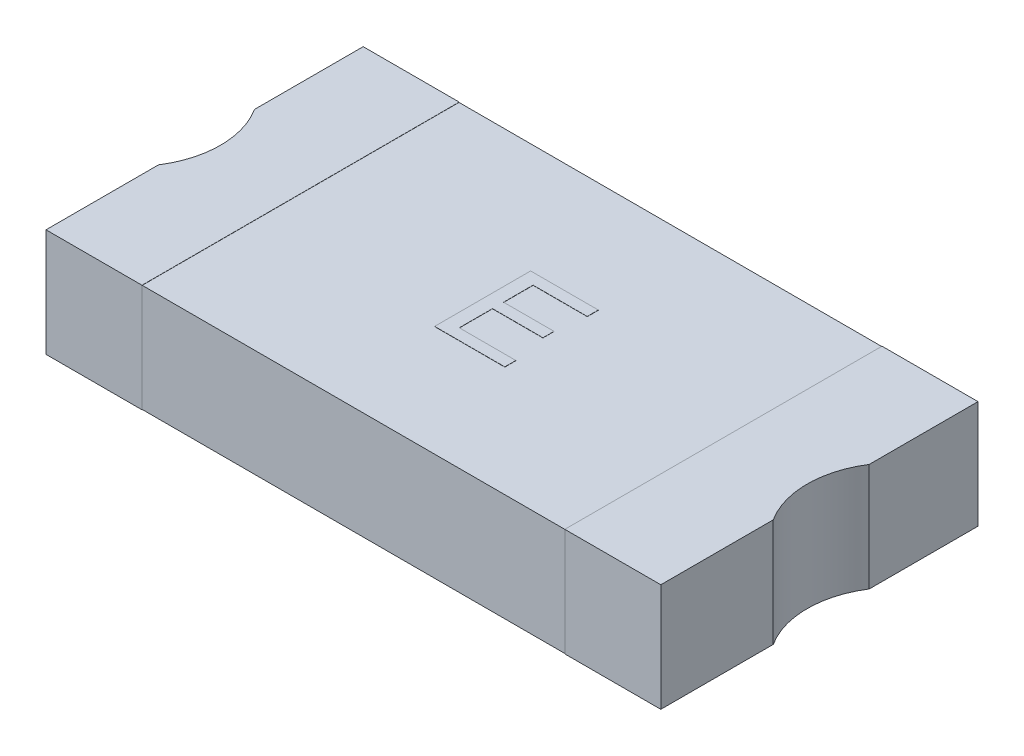
ISO-10303-21;
HEADER;
FILE_DESCRIPTION(('STEP AP214'),'2;1');
FILE_NAME('part.step','',(''),(''),'','','');
FILE_SCHEMA(('AUTOMOTIVE_DESIGN { 1 0 10303 214 1 1 1 1 }'));
ENDSEC;
DATA;
#1=APPLICATION_CONTEXT('core data for automotive mechanical design processes');
#2=APPLICATION_PROTOCOL_DEFINITION('international standard','automotive_design',2000,#1);
#3=PRODUCT_CONTEXT('',#1,'mechanical');
#4=PRODUCT('Part','Part','',(#3));
#5=PRODUCT_RELATED_PRODUCT_CATEGORY('part','',(#4));
#6=PRODUCT_DEFINITION_FORMATION('','',#4);
#7=PRODUCT_DEFINITION_CONTEXT('part definition',#1,'design');
#8=PRODUCT_DEFINITION('design','',#6,#7);
#9=PRODUCT_DEFINITION_SHAPE('','',#8);
#10=(LENGTH_UNIT() NAMED_UNIT(*) SI_UNIT(.MILLI.,.METRE.));
#11=(NAMED_UNIT(*) PLANE_ANGLE_UNIT() SI_UNIT($,.RADIAN.));
#12=(NAMED_UNIT(*) SI_UNIT($,.STERADIAN.) SOLID_ANGLE_UNIT());
#13=UNCERTAINTY_MEASURE_WITH_UNIT(LENGTH_MEASURE(1.E-05),#10,'distance_accuracy_value','');
#14=(GEOMETRIC_REPRESENTATION_CONTEXT(3) GLOBAL_UNCERTAINTY_ASSIGNED_CONTEXT((#13)) GLOBAL_UNIT_ASSIGNED_CONTEXT((#10,
#11,#12)) REPRESENTATION_CONTEXT('',''));
#15=CARTESIAN_POINT('',(0.,0.,0.));
#16=DIRECTION('',(0.,0.,1.));
#17=DIRECTION('',(1.,0.,0.));
#18=AXIS2_PLACEMENT_3D('',#15,#16,#17);
#19=CARTESIAN_POINT('',(-0.153338424141,0.561,0.249571173603));
#20=DIRECTION('',(0.,-1.,0.));
#21=DIRECTION('',(0.,0.,-1.));
#22=AXIS2_PLACEMENT_3D('',#19,#20,#21);
#23=PLANE('',#22);
#24=DIRECTION('',(0.,0.,-1.));
#25=VECTOR('',#24,1.);
#26=CARTESIAN_POINT('',(0.212046191244,0.561,0.19187886591));
#27=LINE('',#26,#25);
#28=CARTESIAN_POINT('',(0.212046191244,0.561,0.19187886591));
#29=VERTEX_POINT('',#28);
#30=CARTESIAN_POINT('',(0.212046191244,0.561,0.249571173603));
#31=VERTEX_POINT('',#30);
#32=EDGE_CURVE('E299',#29,#31,#27,.F.);
#33=ORIENTED_EDGE('',*,*,#32,.F.);
#34=DIRECTION('',(-1.,0.,0.));
#35=VECTOR('',#34,1.);
#36=CARTESIAN_POINT('',(-0.08282560362813,0.561,0.19187886591));
#37=LINE('',#36,#35);
#38=CARTESIAN_POINT('',(-0.08282560362813,0.561,0.19187886591));
#39=VERTEX_POINT('',#38);
#40=EDGE_CURVE('E303',#39,#29,#37,.F.);
#41=ORIENTED_EDGE('',*,*,#40,.F.);
#42=DIRECTION('',(0.,0.,-1.));
#43=VECTOR('',#42,1.);
#44=CARTESIAN_POINT('',(-0.08282560362813,0.561,0.01880194283357));
#45=LINE('',#44,#43);
#46=CARTESIAN_POINT('',(-0.08282560362813,0.561,0.01880194283357));
#47=VERTEX_POINT('',#46);
#48=EDGE_CURVE('E307',#47,#39,#45,.F.);
#49=ORIENTED_EDGE('',*,*,#48,.F.);
#50=DIRECTION('',(1.,0.,0.));
#51=VECTOR('',#50,1.);
#52=CARTESIAN_POINT('',(0.179994909192,0.561,0.01880194283357));
#53=LINE('',#52,#51);
#54=CARTESIAN_POINT('',(0.179994909192,0.561,0.01880194283357));
#55=VERTEX_POINT('',#54);
#56=EDGE_CURVE('E311',#55,#47,#53,.F.);
#57=ORIENTED_EDGE('',*,*,#56,.F.);
#58=DIRECTION('',(0.,0.,-1.));
#59=VECTOR('',#58,1.);
#60=CARTESIAN_POINT('',(0.179994909192,0.561,-0.03889036485874));
#61=LINE('',#60,#59);
#62=CARTESIAN_POINT('',(0.179994909192,0.561,-0.03889036485874));
#63=VERTEX_POINT('',#62);
#64=EDGE_CURVE('E315',#63,#55,#61,.F.);
#65=ORIENTED_EDGE('',*,*,#64,.F.);
#66=DIRECTION('',(-1.,0.,0.));
#67=VECTOR('',#66,1.);
#68=CARTESIAN_POINT('',(-0.08282560362813,0.561,-0.03889036485874));
#69=LINE('',#68,#67);
#70=CARTESIAN_POINT('',(-0.08282560362813,0.561,-0.03889036485874));
#71=VERTEX_POINT('',#70);
#72=EDGE_CURVE('E319',#71,#63,#69,.F.);
#73=ORIENTED_EDGE('',*,*,#72,.F.);
#74=DIRECTION('',(0.,0.,-1.));
#75=VECTOR('',#74,1.);
#76=CARTESIAN_POINT('',(-0.08282560362813,0.561,-0.192736518705));
#77=LINE('',#76,#75);
#78=CARTESIAN_POINT('',(-0.08282560362813,0.561,-0.192736518705));
#79=VERTEX_POINT('',#78);
#80=EDGE_CURVE('E323',#79,#71,#77,.F.);
#81=ORIENTED_EDGE('',*,*,#80,.F.);
#82=DIRECTION('',(1.,0.,0.));
#83=VECTOR('',#82,1.);
#84=CARTESIAN_POINT('',(0.199225678423,0.561,-0.192736518705));
#85=LINE('',#84,#83);
#86=CARTESIAN_POINT('',(0.199225678423,0.561,-0.192736518705));
#87=VERTEX_POINT('',#86);
#88=EDGE_CURVE('E327',#87,#79,#85,.F.);
#89=ORIENTED_EDGE('',*,*,#88,.F.);
#90=DIRECTION('',(0.,0.,-1.));
#91=VECTOR('',#90,1.);
#92=CARTESIAN_POINT('',(0.199225678423,0.561,-0.250428826397));
#93=LINE('',#92,#91);
#94=CARTESIAN_POINT('',(0.199225678423,0.561,-0.250428826397));
#95=VERTEX_POINT('',#94);
#96=EDGE_CURVE('E331',#95,#87,#93,.F.);
#97=ORIENTED_EDGE('',*,*,#96,.F.);
#98=DIRECTION('',(-1.,0.,0.));
#99=VECTOR('',#98,1.);
#100=CARTESIAN_POINT('',(-0.153338424141,0.561,-0.250428826397));
#101=LINE('',#100,#99);
#102=CARTESIAN_POINT('',(-0.153338424141,0.561,-0.250428826397));
#103=VERTEX_POINT('',#102);
#104=EDGE_CURVE('E228',#103,#95,#101,.F.);
#105=ORIENTED_EDGE('',*,*,#104,.F.);
#106=DIRECTION('',(0.,0.,1.));
#107=VECTOR('',#106,1.);
#108=CARTESIAN_POINT('',(-0.153338424141,0.561,0.249571173603));
#109=LINE('',#108,#107);
#110=CARTESIAN_POINT('',(-0.153338424141,0.561,0.249571173603));
#111=VERTEX_POINT('',#110);
#112=EDGE_CURVE('E217',#111,#103,#109,.F.);
#113=ORIENTED_EDGE('',*,*,#112,.F.);
#114=DIRECTION('',(1.,0.,0.));
#115=VECTOR('',#114,1.);
#116=CARTESIAN_POINT('',(0.212046191244,0.561,0.249571173603));
#117=LINE('',#116,#115);
#118=EDGE_CURVE('E214',#31,#111,#117,.F.);
#119=ORIENTED_EDGE('',*,*,#118,.F.);
#120=EDGE_LOOP('',(#33,#41,#49,#57,#65,#73,#81,#89,#97,#105,#113,#119));
#121=FACE_BOUND('',#120,.T.);
#122=ADVANCED_FACE('F17',(#121),#23,.F.);
#123=CARTESIAN_POINT('',(-1.601,0.561,-0.25961123323));
#124=DIRECTION('',(1.,0.,0.));
#125=DIRECTION('',(0.,0.,-1.));
#126=AXIS2_PLACEMENT_3D('',#123,#124,#125);
#127=PLANE('',#126);
#128=DIRECTION('',(0.,0.,1.));
#129=VECTOR('',#128,1.);
#130=CARTESIAN_POINT('',(-1.601,-0.001,-0.009604738494877));
#131=LINE('',#130,#129);
#132=CARTESIAN_POINT('',(-1.601,-0.00100000000000001,-0.826));
#133=VERTEX_POINT('',#132);
#134=CARTESIAN_POINT('',(-1.60099999999998,-0.00100000000000002,-0.259611233230056));
#135=VERTEX_POINT('',#134);
#136=EDGE_CURVE('E250',#133,#135,#131,.T.);
#137=ORIENTED_EDGE('',*,*,#136,.T.);
#138=DIRECTION('',(0.,-1.,0.));
#139=VECTOR('',#138,1.);
#140=CARTESIAN_POINT('',(-1.60099999999996,0.561,-0.259611233230025));
#141=LINE('',#140,#139);
#142=CARTESIAN_POINT('',(-1.60099999999998,0.561,-0.259611233230056));
#143=VERTEX_POINT('',#142);
#144=EDGE_CURVE('E234',#135,#143,#141,.F.);
#145=ORIENTED_EDGE('',*,*,#144,.T.);
#146=DIRECTION('',(0.,0.,1.));
#147=VECTOR('',#146,1.);
#148=CARTESIAN_POINT('',(-1.601,0.561,-0.009604738494877));
#149=LINE('',#148,#147);
#150=CARTESIAN_POINT('',(-1.601,0.561,-0.826));
#151=VERTEX_POINT('',#150);
#152=EDGE_CURVE('E295',#151,#143,#149,.T.);
#153=ORIENTED_EDGE('',*,*,#152,.F.);
#154=DIRECTION('',(0.,1.,0.));
#155=VECTOR('',#154,1.);
#156=CARTESIAN_POINT('',(-1.601,0.561,-0.826));
#157=LINE('',#156,#155);
#158=EDGE_CURVE('E247',#151,#133,#157,.F.);
#159=ORIENTED_EDGE('',*,*,#158,.T.);
#160=EDGE_LOOP('',(#137,#145,#153,#159));
#161=FACE_BOUND('',#160,.T.);
#162=ADVANCED_FACE('F604',(#161),#127,.F.);
#163=CARTESIAN_POINT('',(-1.991021354204,0.561,-0.009604738494877));
#164=DIRECTION('',(0.,-1.,0.));
#165=DIRECTION('',(0.,0.,-1.));
#166=AXIS2_PLACEMENT_3D('',#163,#164,#165);
#167=CYLINDRICAL_SURFACE('',#166,0.463270875563);
#168=DIRECTION('',(0.,1.,0.));
#169=VECTOR('',#168,1.);
#170=CARTESIAN_POINT('',(-1.601,0.561,0.24040175624));
#171=LINE('',#170,#169);
#172=CARTESIAN_POINT('',(-1.601,-0.00100000000000002,0.240401756240166));
#173=VERTEX_POINT('',#172);
#174=CARTESIAN_POINT('',(-1.601,0.561,0.240401756240166));
#175=VERTEX_POINT('',#174);
#176=EDGE_CURVE('E231',#173,#175,#171,.T.);
#177=ORIENTED_EDGE('',*,*,#176,.T.);
#178=CARTESIAN_POINT('',(-1.991021354204,0.561,-0.009604738494877));
#179=DIRECTION('',(0.,-1.,0.));
#180=DIRECTION('',(0.,0.,-1.));
#181=AXIS2_PLACEMENT_3D('',#178,#179,#180);
#182=CIRCLE('',#181,0.463270875563);
#183=EDGE_CURVE('E293',#143,#175,#182,.T.);
#184=ORIENTED_EDGE('',*,*,#183,.F.);
#185=ORIENTED_EDGE('',*,*,#144,.F.);
#186=CARTESIAN_POINT('',(-1.991021354204,-0.00100000000000002,-0.009604738494877));
#187=DIRECTION('',(0.,-1.,0.));
#188=DIRECTION('',(0.,0.,-1.));
#189=AXIS2_PLACEMENT_3D('',#186,#187,#188);
#190=CIRCLE('',#189,0.463270875563);
#191=EDGE_CURVE('E290',#135,#173,#190,.T.);
#192=ORIENTED_EDGE('',*,*,#191,.T.);
#193=EDGE_LOOP('',(#177,#184,#185,#192));
#194=FACE_BOUND('',#193,.T.);
#195=ADVANCED_FACE('F601',(#194),#167,.F.);
#196=CARTESIAN_POINT('',(-1.601,0.561,0.826));
#197=DIRECTION('',(1.,0.,0.));
#198=DIRECTION('',(0.,0.,-1.));
#199=AXIS2_PLACEMENT_3D('',#196,#197,#198);
#200=PLANE('',#199);
#201=DIRECTION('',(0.,0.,1.));
#202=VECTOR('',#201,1.);
#203=CARTESIAN_POINT('',(-1.601,-0.001,-0.009604738494877));
#204=LINE('',#203,#202);
#205=CARTESIAN_POINT('',(-1.601,-0.001,0.826));
#206=VERTEX_POINT('',#205);
#207=EDGE_CURVE('E257',#173,#206,#204,.T.);
#208=ORIENTED_EDGE('',*,*,#207,.T.);
#209=DIRECTION('',(0.,1.,0.));
#210=VECTOR('',#209,1.);
#211=CARTESIAN_POINT('',(-1.601,0.561,0.826));
#212=LINE('',#211,#210);
#213=CARTESIAN_POINT('',(-1.601,0.561,0.826));
#214=VERTEX_POINT('',#213);
#215=EDGE_CURVE('E208',#206,#214,#212,.T.);
#216=ORIENTED_EDGE('',*,*,#215,.T.);
#217=DIRECTION('',(0.,0.,1.));
#218=VECTOR('',#217,1.);
#219=CARTESIAN_POINT('',(-1.601,0.561,-0.009604738494877));
#220=LINE('',#219,#218);
#221=EDGE_CURVE('E262',#175,#214,#220,.T.);
#222=ORIENTED_EDGE('',*,*,#221,.F.);
#223=ORIENTED_EDGE('',*,*,#176,.F.);
#224=EDGE_LOOP('',(#208,#216,#222,#223));
#225=FACE_BOUND('',#224,.T.);
#226=ADVANCED_FACE('F598',(#225),#200,.F.);
#227=CARTESIAN_POINT('',(0.212046191244,0.561,0.249571173603));
#228=DIRECTION('',(0.,0.,1.));
#229=DIRECTION('',(1.,0.,0.));
#230=AXIS2_PLACEMENT_3D('',#227,#228,#229);
#231=PLANE('',#230);
#232=ORIENTED_EDGE('',*,*,#118,.T.);
#233=DIRECTION('',(0.,1.,0.));
#234=VECTOR('',#233,1.);
#235=CARTESIAN_POINT('',(-0.153338424141,0.561,0.249571173603));
#236=LINE('',#235,#234);
#237=CARTESIAN_POINT('',(-0.153338424141,0.56,0.249571173603));
#238=VERTEX_POINT('',#237);
#239=EDGE_CURVE('E20',#238,#111,#236,.T.);
#240=ORIENTED_EDGE('',*,*,#239,.F.);
#241=DIRECTION('',(1.,0.,0.));
#242=VECTOR('',#241,1.);
#243=CARTESIAN_POINT('',(0.,0.56,0.249571173603));
#244=LINE('',#243,#242);
#245=CARTESIAN_POINT('',(0.212046191244,0.56,0.249571173603));
#246=VERTEX_POINT('',#245);
#247=EDGE_CURVE('E198',#246,#238,#244,.F.);
#248=ORIENTED_EDGE('',*,*,#247,.F.);
#249=DIRECTION('',(0.,1.,0.));
#250=VECTOR('',#249,1.);
#251=CARTESIAN_POINT('',(0.212046191244,0.561,0.249571173603));
#252=LINE('',#251,#250);
#253=EDGE_CURVE('E296',#31,#246,#252,.F.);
#254=ORIENTED_EDGE('',*,*,#253,.F.);
#255=EDGE_LOOP('',(#232,#240,#248,#254));
#256=FACE_BOUND('',#255,.T.);
#257=ADVANCED_FACE('F212',(#256),#231,.T.);
#258=CARTESIAN_POINT('',(-0.153338424141,0.561,0.249571173603));
#259=DIRECTION('',(-1.,0.,0.));
#260=DIRECTION('',(0.,0.,1.));
#261=AXIS2_PLACEMENT_3D('',#258,#259,#260);
#262=PLANE('',#261);
#263=ORIENTED_EDGE('',*,*,#112,.T.);
#264=DIRECTION('',(0.,1.,0.));
#265=VECTOR('',#264,1.);
#266=CARTESIAN_POINT('',(-0.153338424141,0.561,-0.250428826397));
#267=LINE('',#266,#265);
#268=CARTESIAN_POINT('',(-0.153338424141,0.56,-0.250428826397));
#269=VERTEX_POINT('',#268);
#270=EDGE_CURVE('E220',#269,#103,#267,.T.);
#271=ORIENTED_EDGE('',*,*,#270,.F.);
#272=DIRECTION('',(0.,0.,1.));
#273=VECTOR('',#272,1.);
#274=CARTESIAN_POINT('',(-0.153338424141,0.56,0.));
#275=LINE('',#274,#273);
#276=EDGE_CURVE('E202',#238,#269,#275,.F.);
#277=ORIENTED_EDGE('',*,*,#276,.F.);
#278=ORIENTED_EDGE('',*,*,#239,.T.);
#279=EDGE_LOOP('',(#263,#271,#277,#278));
#280=FACE_BOUND('',#279,.T.);
#281=ADVANCED_FACE('F218',(#280),#262,.T.);
#282=CARTESIAN_POINT('',(-0.153338424141,0.561,-0.250428826397));
#283=DIRECTION('',(0.,0.,-1.));
#284=DIRECTION('',(-1.,0.,0.));
#285=AXIS2_PLACEMENT_3D('',#282,#283,#284);
#286=PLANE('',#285);
#287=ORIENTED_EDGE('',*,*,#104,.T.);
#288=DIRECTION('',(0.,1.,0.));
#289=VECTOR('',#288,1.);
#290=CARTESIAN_POINT('',(0.199225678423,0.561,-0.250428826397));
#291=LINE('',#290,#289);
#292=CARTESIAN_POINT('',(0.199225678423,0.56,-0.250428826397));
#293=VERTEX_POINT('',#292);
#294=EDGE_CURVE('E332',#293,#95,#291,.T.);
#295=ORIENTED_EDGE('',*,*,#294,.F.);
#296=DIRECTION('',(1.,0.,0.));
#297=VECTOR('',#296,1.);
#298=CARTESIAN_POINT('',(0.,0.56,-0.250428826397));
#299=LINE('',#298,#297);
#300=EDGE_CURVE('E222',#269,#293,#299,.T.);
#301=ORIENTED_EDGE('',*,*,#300,.F.);
#302=ORIENTED_EDGE('',*,*,#270,.T.);
#303=EDGE_LOOP('',(#287,#295,#301,#302));
#304=FACE_BOUND('',#303,.T.);
#305=ADVANCED_FACE('F337',(#304),#286,.T.);
#306=CARTESIAN_POINT('',(0.199225678423,0.561,-0.250428826397));
#307=DIRECTION('',(1.,0.,0.));
#308=DIRECTION('',(0.,0.,-1.));
#309=AXIS2_PLACEMENT_3D('',#306,#307,#308);
#310=PLANE('',#309);
#311=ORIENTED_EDGE('',*,*,#96,.T.);
#312=DIRECTION('',(0.,1.,0.));
#313=VECTOR('',#312,1.);
#314=CARTESIAN_POINT('',(0.199225678423,0.561,-0.192736518705));
#315=LINE('',#314,#313);
#316=CARTESIAN_POINT('',(0.199225678423,0.56,-0.192736518705));
#317=VERTEX_POINT('',#316);
#318=EDGE_CURVE('E328',#317,#87,#315,.T.);
#319=ORIENTED_EDGE('',*,*,#318,.F.);
#320=DIRECTION('',(0.,0.,1.));
#321=VECTOR('',#320,1.);
#322=CARTESIAN_POINT('',(0.199225678423,0.56,0.));
#323=LINE('',#322,#321);
#324=EDGE_CURVE('E224',#293,#317,#323,.T.);
#325=ORIENTED_EDGE('',*,*,#324,.F.);
#326=ORIENTED_EDGE('',*,*,#294,.T.);
#327=EDGE_LOOP('',(#311,#319,#325,#326));
#328=FACE_BOUND('',#327,.T.);
#329=ADVANCED_FACE('F342',(#328),#310,.T.);
#330=CARTESIAN_POINT('',(0.199225678423,0.561,-0.192736518705));
#331=DIRECTION('',(0.,0.,1.));
#332=DIRECTION('',(1.,0.,0.));
#333=AXIS2_PLACEMENT_3D('',#330,#331,#332);
#334=PLANE('',#333);
#335=ORIENTED_EDGE('',*,*,#88,.T.);
#336=DIRECTION('',(0.,1.,0.));
#337=VECTOR('',#336,1.);
#338=CARTESIAN_POINT('',(-0.08282560362813,0.561,-0.192736518705));
#339=LINE('',#338,#337);
#340=CARTESIAN_POINT('',(-0.08282560362813,0.56,-0.192736518705));
#341=VERTEX_POINT('',#340);
#342=EDGE_CURVE('E324',#341,#79,#339,.T.);
#343=ORIENTED_EDGE('',*,*,#342,.F.);
#344=DIRECTION('',(1.,0.,0.));
#345=VECTOR('',#344,1.);
#346=CARTESIAN_POINT('',(0.,0.56,-0.192736518705));
#347=LINE('',#346,#345);
#348=EDGE_CURVE('E350',#317,#341,#347,.F.);
#349=ORIENTED_EDGE('',*,*,#348,.F.);
#350=ORIENTED_EDGE('',*,*,#318,.T.);
#351=EDGE_LOOP('',(#335,#343,#349,#350));
#352=FACE_BOUND('',#351,.T.);
#353=ADVANCED_FACE('F585',(#352),#334,.T.);
#354=CARTESIAN_POINT('',(-0.08282560362813,0.561,-0.192736518705));
#355=DIRECTION('',(1.,0.,0.));
#356=DIRECTION('',(0.,0.,-1.));
#357=AXIS2_PLACEMENT_3D('',#354,#355,#356);
#358=PLANE('',#357);
#359=ORIENTED_EDGE('',*,*,#80,.T.);
#360=DIRECTION('',(0.,1.,0.));
#361=VECTOR('',#360,1.);
#362=CARTESIAN_POINT('',(-0.08282560362813,0.561,-0.03889036485874));
#363=LINE('',#362,#361);
#364=CARTESIAN_POINT('',(-0.08282560362813,0.56,-0.03889036485874));
#365=VERTEX_POINT('',#364);
#366=EDGE_CURVE('E320',#365,#71,#363,.T.);
#367=ORIENTED_EDGE('',*,*,#366,.F.);
#368=DIRECTION('',(0.,0.,1.));
#369=VECTOR('',#368,1.);
#370=CARTESIAN_POINT('',(-0.08282560362813,0.56,0.));
#371=LINE('',#370,#369);
#372=EDGE_CURVE('E353',#341,#365,#371,.T.);
#373=ORIENTED_EDGE('',*,*,#372,.F.);
#374=ORIENTED_EDGE('',*,*,#342,.T.);
#375=EDGE_LOOP('',(#359,#367,#373,#374));
#376=FACE_BOUND('',#375,.T.);
#377=ADVANCED_FACE('F581',(#376),#358,.T.);
#378=CARTESIAN_POINT('',(-0.08282560362813,0.561,-0.03889036485874));
#379=DIRECTION('',(0.,0.,-1.));
#380=DIRECTION('',(-1.,0.,0.));
#381=AXIS2_PLACEMENT_3D('',#378,#379,#380);
#382=PLANE('',#381);
#383=ORIENTED_EDGE('',*,*,#72,.T.);
#384=DIRECTION('',(0.,1.,0.));
#385=VECTOR('',#384,1.);
#386=CARTESIAN_POINT('',(0.179994909192,0.561,-0.03889036485874));
#387=LINE('',#386,#385);
#388=CARTESIAN_POINT('',(0.179994909192,0.56,-0.03889036485874));
#389=VERTEX_POINT('',#388);
#390=EDGE_CURVE('E316',#389,#63,#387,.T.);
#391=ORIENTED_EDGE('',*,*,#390,.F.);
#392=DIRECTION('',(1.,0.,0.));
#393=VECTOR('',#392,1.);
#394=CARTESIAN_POINT('',(0.,0.56,-0.03889036485874));
#395=LINE('',#394,#393);
#396=EDGE_CURVE('E356',#365,#389,#395,.T.);
#397=ORIENTED_EDGE('',*,*,#396,.F.);
#398=ORIENTED_EDGE('',*,*,#366,.T.);
#399=EDGE_LOOP('',(#383,#391,#397,#398));
#400=FACE_BOUND('',#399,.T.);
#401=ADVANCED_FACE('F577',(#400),#382,.T.);
#402=CARTESIAN_POINT('',(0.179994909192,0.561,-0.03889036485874));
#403=DIRECTION('',(1.,0.,0.));
#404=DIRECTION('',(0.,0.,-1.));
#405=AXIS2_PLACEMENT_3D('',#402,#403,#404);
#406=PLANE('',#405);
#407=ORIENTED_EDGE('',*,*,#64,.T.);
#408=DIRECTION('',(0.,1.,0.));
#409=VECTOR('',#408,1.);
#410=CARTESIAN_POINT('',(0.179994909192,0.561,0.01880194283357));
#411=LINE('',#410,#409);
#412=CARTESIAN_POINT('',(0.179994909192,0.56,0.01880194283357));
#413=VERTEX_POINT('',#412);
#414=EDGE_CURVE('E312',#413,#55,#411,.T.);
#415=ORIENTED_EDGE('',*,*,#414,.F.);
#416=DIRECTION('',(0.,0.,1.));
#417=VECTOR('',#416,1.);
#418=CARTESIAN_POINT('',(0.179994909192,0.56,0.));
#419=LINE('',#418,#417);
#420=EDGE_CURVE('E359',#389,#413,#419,.T.);
#421=ORIENTED_EDGE('',*,*,#420,.F.);
#422=ORIENTED_EDGE('',*,*,#390,.T.);
#423=EDGE_LOOP('',(#407,#415,#421,#422));
#424=FACE_BOUND('',#423,.T.);
#425=ADVANCED_FACE('F573',(#424),#406,.T.);
#426=CARTESIAN_POINT('',(0.179994909192,0.561,0.01880194283357));
#427=DIRECTION('',(0.,0.,1.));
#428=DIRECTION('',(1.,0.,0.));
#429=AXIS2_PLACEMENT_3D('',#426,#427,#428);
#430=PLANE('',#429);
#431=ORIENTED_EDGE('',*,*,#56,.T.);
#432=DIRECTION('',(0.,1.,0.));
#433=VECTOR('',#432,1.);
#434=CARTESIAN_POINT('',(-0.08282560362813,0.561,0.01880194283357));
#435=LINE('',#434,#433);
#436=CARTESIAN_POINT('',(-0.08282560362813,0.56,0.01880194283357));
#437=VERTEX_POINT('',#436);
#438=EDGE_CURVE('E308',#437,#47,#435,.T.);
#439=ORIENTED_EDGE('',*,*,#438,.F.);
#440=DIRECTION('',(1.,0.,0.));
#441=VECTOR('',#440,1.);
#442=CARTESIAN_POINT('',(0.,0.56,0.01880194283357));
#443=LINE('',#442,#441);
#444=EDGE_CURVE('E362',#413,#437,#443,.F.);
#445=ORIENTED_EDGE('',*,*,#444,.F.);
#446=ORIENTED_EDGE('',*,*,#414,.T.);
#447=EDGE_LOOP('',(#431,#439,#445,#446));
#448=FACE_BOUND('',#447,.T.);
#449=ADVANCED_FACE('F569',(#448),#430,.T.);
#450=CARTESIAN_POINT('',(-0.08282560362813,0.561,0.01880194283357));
#451=DIRECTION('',(1.,0.,0.));
#452=DIRECTION('',(0.,0.,-1.));
#453=AXIS2_PLACEMENT_3D('',#450,#451,#452);
#454=PLANE('',#453);
#455=ORIENTED_EDGE('',*,*,#48,.T.);
#456=DIRECTION('',(0.,1.,0.));
#457=VECTOR('',#456,1.);
#458=CARTESIAN_POINT('',(-0.08282560362813,0.561,0.19187886591));
#459=LINE('',#458,#457);
#460=CARTESIAN_POINT('',(-0.08282560362813,0.56,0.19187886591));
#461=VERTEX_POINT('',#460);
#462=EDGE_CURVE('E304',#461,#39,#459,.T.);
#463=ORIENTED_EDGE('',*,*,#462,.F.);
#464=DIRECTION('',(0.,0.,1.));
#465=VECTOR('',#464,1.);
#466=CARTESIAN_POINT('',(-0.08282560362813,0.56,0.));
#467=LINE('',#466,#465);
#468=EDGE_CURVE('E365',#437,#461,#467,.T.);
#469=ORIENTED_EDGE('',*,*,#468,.F.);
#470=ORIENTED_EDGE('',*,*,#438,.T.);
#471=EDGE_LOOP('',(#455,#463,#469,#470));
#472=FACE_BOUND('',#471,.T.);
#473=ADVANCED_FACE('F565',(#472),#454,.T.);
#474=CARTESIAN_POINT('',(-0.08282560362813,0.561,0.19187886591));
#475=DIRECTION('',(0.,0.,-1.));
#476=DIRECTION('',(-1.,0.,0.));
#477=AXIS2_PLACEMENT_3D('',#474,#475,#476);
#478=PLANE('',#477);
#479=ORIENTED_EDGE('',*,*,#40,.T.);
#480=DIRECTION('',(0.,1.,0.));
#481=VECTOR('',#480,1.);
#482=CARTESIAN_POINT('',(0.212046191244,0.561,0.19187886591));
#483=LINE('',#482,#481);
#484=CARTESIAN_POINT('',(0.212046191244,0.56,0.19187886591));
#485=VERTEX_POINT('',#484);
#486=EDGE_CURVE('E300',#485,#29,#483,.T.);
#487=ORIENTED_EDGE('',*,*,#486,.F.);
#488=DIRECTION('',(1.,0.,0.));
#489=VECTOR('',#488,1.);
#490=CARTESIAN_POINT('',(0.,0.56,0.19187886591));
#491=LINE('',#490,#489);
#492=EDGE_CURVE('E368',#461,#485,#491,.T.);
#493=ORIENTED_EDGE('',*,*,#492,.F.);
#494=ORIENTED_EDGE('',*,*,#462,.T.);
#495=EDGE_LOOP('',(#479,#487,#493,#494));
#496=FACE_BOUND('',#495,.T.);
#497=ADVANCED_FACE('F561',(#496),#478,.T.);
#498=CARTESIAN_POINT('',(0.212046191244,0.561,0.19187886591));
#499=DIRECTION('',(1.,0.,0.));
#500=DIRECTION('',(0.,0.,-1.));
#501=AXIS2_PLACEMENT_3D('',#498,#499,#500);
#502=PLANE('',#501);
#503=ORIENTED_EDGE('',*,*,#32,.T.);
#504=ORIENTED_EDGE('',*,*,#253,.T.);
#505=DIRECTION('',(0.,0.,1.));
#506=VECTOR('',#505,1.);
#507=CARTESIAN_POINT('',(0.212046191244,0.56,0.));
#508=LINE('',#507,#506);
#509=EDGE_CURVE('E205',#485,#246,#508,.T.);
#510=ORIENTED_EDGE('',*,*,#509,.F.);
#511=ORIENTED_EDGE('',*,*,#486,.T.);
#512=EDGE_LOOP('',(#503,#504,#510,#511));
#513=FACE_BOUND('',#512,.T.);
#514=ADVANCED_FACE('F557',(#513),#502,.T.);
#515=CARTESIAN_POINT('',(1.991021354204,0.561,-0.009604738494878));
#516=DIRECTION('',(0.,-1.,0.));
#517=DIRECTION('',(0.,0.,-1.));
#518=AXIS2_PLACEMENT_3D('',#515,#516,#517);
#519=CYLINDRICAL_SURFACE('',#518,0.463270875563);
#520=DIRECTION('',(0.,1.,0.));
#521=VECTOR('',#520,1.);
#522=CARTESIAN_POINT('',(1.601,0.561,-0.25961123323));
#523=LINE('',#522,#521);
#524=CARTESIAN_POINT('',(1.601,-0.00100000000000002,-0.259611233230044));
#525=VERTEX_POINT('',#524);
#526=CARTESIAN_POINT('',(1.601,0.561,-0.259611233230044));
#527=VERTEX_POINT('',#526);
#528=EDGE_CURVE('E406',#525,#527,#523,.T.);
#529=ORIENTED_EDGE('',*,*,#528,.T.);
#530=CARTESIAN_POINT('',(1.991021354204,0.561,-0.009604738494878));
#531=DIRECTION('',(0.,-1.,0.));
#532=DIRECTION('',(0.,0.,-1.));
#533=AXIS2_PLACEMENT_3D('',#530,#531,#532);
#534=CIRCLE('',#533,0.463270875563);
#535=CARTESIAN_POINT('',(1.601,0.561,0.240401756240166));
#536=VERTEX_POINT('',#535);
#537=EDGE_CURVE('E285',#527,#536,#534,.F.);
#538=ORIENTED_EDGE('',*,*,#537,.T.);
#539=DIRECTION('',(0.,1.,0.));
#540=VECTOR('',#539,1.);
#541=CARTESIAN_POINT('',(1.601,0.561,0.24040175624));
#542=LINE('',#541,#540);
#543=CARTESIAN_POINT('',(1.601,-0.00100000000000002,0.240401756240166));
#544=VERTEX_POINT('',#543);
#545=EDGE_CURVE('E298',#536,#544,#542,.F.);
#546=ORIENTED_EDGE('',*,*,#545,.T.);
#547=CARTESIAN_POINT('',(1.991021354204,-0.00100000000000002,-0.009604738494878));
#548=DIRECTION('',(0.,-1.,0.));
#549=DIRECTION('',(0.,0.,-1.));
#550=AXIS2_PLACEMENT_3D('',#547,#548,#549);
#551=CIRCLE('',#550,0.463270875563);
#552=EDGE_CURVE('E281',#525,#544,#551,.F.);
#553=ORIENTED_EDGE('',*,*,#552,.F.);
#554=EDGE_LOOP('',(#529,#538,#546,#553));
#555=FACE_BOUND('',#554,.T.);
#556=ADVANCED_FACE('F553',(#555),#519,.F.);
#557=CARTESIAN_POINT('',(1.601,0.561,0.826));
#558=DIRECTION('',(-1.,0.,0.));
#559=DIRECTION('',(0.,0.,1.));
#560=AXIS2_PLACEMENT_3D('',#557,#558,#559);
#561=PLANE('',#560);
#562=DIRECTION('',(0.,0.,-1.));
#563=VECTOR('',#562,1.);
#564=CARTESIAN_POINT('',(1.601,-0.001,-0.009604738494878));
#565=LINE('',#564,#563);
#566=CARTESIAN_POINT('',(1.601,-0.00100000000000001,0.826));
#567=VERTEX_POINT('',#566);
#568=EDGE_CURVE('E283',#544,#567,#565,.F.);
#569=ORIENTED_EDGE('',*,*,#568,.F.);
#570=ORIENTED_EDGE('',*,*,#545,.F.);
#571=DIRECTION('',(0.,0.,-1.));
#572=VECTOR('',#571,1.);
#573=CARTESIAN_POINT('',(1.601,0.561,-0.009604738494878));
#574=LINE('',#573,#572);
#575=CARTESIAN_POINT('',(1.601,0.561,0.826));
#576=VERTEX_POINT('',#575);
#577=EDGE_CURVE('E432',#536,#576,#574,.F.);
#578=ORIENTED_EDGE('',*,*,#577,.T.);
#579=DIRECTION('',(0.,1.,0.));
#580=VECTOR('',#579,1.);
#581=CARTESIAN_POINT('',(1.601,0.561,0.826));
#582=LINE('',#581,#580);
#583=EDGE_CURVE('E284',#576,#567,#582,.F.);
#584=ORIENTED_EDGE('',*,*,#583,.T.);
#585=EDGE_LOOP('',(#569,#570,#578,#584));
#586=FACE_BOUND('',#585,.T.);
#587=ADVANCED_FACE('F549',(#586),#561,.F.);
#588=CARTESIAN_POINT('',(1.601,0.561,-0.25961123323));
#589=DIRECTION('',(-1.,0.,0.));
#590=DIRECTION('',(0.,0.,1.));
#591=AXIS2_PLACEMENT_3D('',#588,#589,#590);
#592=PLANE('',#591);
#593=DIRECTION('',(0.,0.,-1.));
#594=VECTOR('',#593,1.);
#595=CARTESIAN_POINT('',(1.601,-0.001,-0.009604738494878));
#596=LINE('',#595,#594);
#597=CARTESIAN_POINT('',(1.601,-0.001,-0.826));
#598=VERTEX_POINT('',#597);
#599=EDGE_CURVE('E380',#598,#525,#596,.F.);
#600=ORIENTED_EDGE('',*,*,#599,.F.);
#601=DIRECTION('',(0.,1.,0.));
#602=VECTOR('',#601,1.);
#603=CARTESIAN_POINT('',(1.601,0.561,-0.826));
#604=LINE('',#603,#602);
#605=CARTESIAN_POINT('',(1.601,0.561,-0.826));
#606=VERTEX_POINT('',#605);
#607=EDGE_CURVE('E411',#598,#606,#604,.T.);
#608=ORIENTED_EDGE('',*,*,#607,.T.);
#609=DIRECTION('',(0.,0.,-1.));
#610=VECTOR('',#609,1.);
#611=CARTESIAN_POINT('',(1.601,0.561,-0.009604738494878));
#612=LINE('',#611,#610);
#613=EDGE_CURVE('E289',#606,#527,#612,.F.);
#614=ORIENTED_EDGE('',*,*,#613,.T.);
#615=ORIENTED_EDGE('',*,*,#528,.F.);
#616=EDGE_LOOP('',(#600,#608,#614,#615));
#617=FACE_BOUND('',#616,.T.);
#618=ADVANCED_FACE('F545',(#617),#592,.F.);
#619=CARTESIAN_POINT('',(-1.991021354204,0.561,-0.009604738494877));
#620=DIRECTION('',(0.,1.,0.));
#621=DIRECTION('',(0.,0.,1.));
#622=AXIS2_PLACEMENT_3D('',#619,#620,#621);
#623=PLANE('',#622);
#624=DIRECTION('',(-1.,0.,0.));
#625=VECTOR('',#624,1.);
#626=CARTESIAN_POINT('',(-1.101,0.561,0.826));
#627=LINE('',#626,#625);
#628=CARTESIAN_POINT('',(-1.101,0.561,0.826));
#629=VERTEX_POINT('',#628);
#630=EDGE_CURVE('E242',#214,#629,#627,.F.);
#631=ORIENTED_EDGE('',*,*,#630,.T.);
#632=DIRECTION('',(0.,0.,1.));
#633=VECTOR('',#632,1.);
#634=CARTESIAN_POINT('',(-1.101,0.561,-0.826));
#635=LINE('',#634,#633);
#636=CARTESIAN_POINT('',(-1.101,0.561,-0.826));
#637=VERTEX_POINT('',#636);
#638=EDGE_CURVE('E269',#629,#637,#635,.F.);
#639=ORIENTED_EDGE('',*,*,#638,.T.);
#640=DIRECTION('',(1.,0.,0.));
#641=VECTOR('',#640,1.);
#642=CARTESIAN_POINT('',(-1.601,0.561,-0.826));
#643=LINE('',#642,#641);
#644=EDGE_CURVE('E251',#637,#151,#643,.F.);
#645=ORIENTED_EDGE('',*,*,#644,.T.);
#646=ORIENTED_EDGE('',*,*,#152,.T.);
#647=ORIENTED_EDGE('',*,*,#183,.T.);
#648=ORIENTED_EDGE('',*,*,#221,.T.);
#649=EDGE_LOOP('',(#631,#639,#645,#646,#647,#648));
#650=FACE_BOUND('',#649,.T.);
#651=ADVANCED_FACE('F541',(#650),#623,.T.);
#652=CARTESIAN_POINT('',(-1.601,0.561,-0.826));
#653=DIRECTION('',(0.,0.,1.));
#654=DIRECTION('',(1.,0.,0.));
#655=AXIS2_PLACEMENT_3D('',#652,#653,#654);
#656=PLANE('',#655);
#657=DIRECTION('',(1.,0.,0.));
#658=VECTOR('',#657,1.);
#659=CARTESIAN_POINT('',(-1.991021354204,-0.001,-0.826));
#660=LINE('',#659,#658);
#661=CARTESIAN_POINT('',(-1.101,-0.00100000000000002,-0.826));
#662=VERTEX_POINT('',#661);
#663=EDGE_CURVE('E254',#662,#133,#660,.F.);
#664=ORIENTED_EDGE('',*,*,#663,.T.);
#665=ORIENTED_EDGE('',*,*,#158,.F.);
#666=ORIENTED_EDGE('',*,*,#644,.F.);
#667=DIRECTION('',(0.,1.,0.));
#668=VECTOR('',#667,1.);
#669=CARTESIAN_POINT('',(-1.101,0.561,-0.826));
#670=LINE('',#669,#668);
#671=EDGE_CURVE('E265',#637,#662,#670,.F.);
#672=ORIENTED_EDGE('',*,*,#671,.T.);
#673=EDGE_LOOP('',(#664,#665,#666,#672));
#674=FACE_BOUND('',#673,.T.);
#675=ADVANCED_FACE('F537',(#674),#656,.F.);
#676=CARTESIAN_POINT('',(-1.991021354204,-0.001,-0.009604738494877));
#677=DIRECTION('',(0.,1.,0.));
#678=DIRECTION('',(0.,0.,1.));
#679=AXIS2_PLACEMENT_3D('',#676,#677,#678);
#680=PLANE('',#679);
#681=DIRECTION('',(0.,0.,1.));
#682=VECTOR('',#681,1.);
#683=CARTESIAN_POINT('',(-1.101,-0.00100000000000002,-0.826));
#684=LINE('',#683,#682);
#685=CARTESIAN_POINT('',(-1.101,-0.00100000000000001,0.826));
#686=VERTEX_POINT('',#685);
#687=EDGE_CURVE('E268',#662,#686,#684,.T.);
#688=ORIENTED_EDGE('',*,*,#687,.T.);
#689=DIRECTION('',(-1.,0.,0.));
#690=VECTOR('',#689,1.);
#691=CARTESIAN_POINT('',(-1.101,-0.00100000000000002,0.826));
#692=LINE('',#691,#690);
#693=EDGE_CURVE('E237',#686,#206,#692,.T.);
#694=ORIENTED_EDGE('',*,*,#693,.T.);
#695=ORIENTED_EDGE('',*,*,#207,.F.);
#696=ORIENTED_EDGE('',*,*,#191,.F.);
#697=ORIENTED_EDGE('',*,*,#136,.F.);
#698=ORIENTED_EDGE('',*,*,#663,.F.);
#699=EDGE_LOOP('',(#688,#694,#695,#696,#697,#698));
#700=FACE_BOUND('',#699,.T.);
#701=ADVANCED_FACE('F533',(#700),#680,.F.);
#702=CARTESIAN_POINT('',(-1.101,0.561,0.826));
#703=DIRECTION('',(0.,0.,-1.));
#704=DIRECTION('',(-1.,0.,0.));
#705=AXIS2_PLACEMENT_3D('',#702,#703,#704);
#706=PLANE('',#705);
#707=ORIENTED_EDGE('',*,*,#693,.F.);
#708=DIRECTION('',(0.,1.,0.));
#709=VECTOR('',#708,1.);
#710=CARTESIAN_POINT('',(-1.101,0.561,0.826));
#711=LINE('',#710,#709);
#712=EDGE_CURVE('E455',#686,#629,#711,.T.);
#713=ORIENTED_EDGE('',*,*,#712,.T.);
#714=ORIENTED_EDGE('',*,*,#630,.F.);
#715=ORIENTED_EDGE('',*,*,#215,.F.);
#716=EDGE_LOOP('',(#707,#713,#714,#715));
#717=FACE_BOUND('',#716,.T.);
#718=ADVANCED_FACE('F529',(#717),#706,.F.);
#719=CARTESIAN_POINT('',(0.,0.56,0.));
#720=DIRECTION('',(0.,1.,0.));
#721=DIRECTION('',(0.,0.,1.));
#722=AXIS2_PLACEMENT_3D('',#719,#720,#721);
#723=PLANE('',#722);
#724=DIRECTION('',(-1.,0.,0.));
#725=VECTOR('',#724,1.);
#726=CARTESIAN_POINT('',(0.,0.56,-0.825));
#727=LINE('',#726,#725);
#728=CARTESIAN_POINT('',(-1.101,0.56,-0.825));
#729=VERTEX_POINT('',#728);
#730=CARTESIAN_POINT('',(1.101,0.56,-0.825));
#731=VERTEX_POINT('',#730);
#732=EDGE_CURVE('E416',#729,#731,#727,.F.);
#733=ORIENTED_EDGE('',*,*,#732,.F.);
#734=DIRECTION('',(0.,0.,1.));
#735=VECTOR('',#734,1.);
#736=CARTESIAN_POINT('',(-1.101,0.56,-0.826));
#737=LINE('',#736,#735);
#738=CARTESIAN_POINT('',(-1.101,0.56,0.825));
#739=VERTEX_POINT('',#738);
#740=EDGE_CURVE('E274',#729,#739,#737,.T.);
#741=ORIENTED_EDGE('',*,*,#740,.T.);
#742=DIRECTION('',(-1.,0.,0.));
#743=VECTOR('',#742,1.);
#744=CARTESIAN_POINT('',(0.,0.56,0.825));
#745=LINE('',#744,#743);
#746=CARTESIAN_POINT('',(1.101,0.56,0.825));
#747=VERTEX_POINT('',#746);
#748=EDGE_CURVE('E461',#739,#747,#745,.F.);
#749=ORIENTED_EDGE('',*,*,#748,.T.);
#750=DIRECTION('',(0.,0.,1.));
#751=VECTOR('',#750,1.);
#752=CARTESIAN_POINT('',(1.101,0.56,0.));
#753=LINE('',#752,#751);
#754=EDGE_CURVE('E371',#747,#731,#753,.F.);
#755=ORIENTED_EDGE('',*,*,#754,.T.);
#756=EDGE_LOOP('',(#733,#741,#749,#755));
#757=FACE_BOUND('',#756,.T.);
#758=ORIENTED_EDGE('',*,*,#492,.T.);
#759=ORIENTED_EDGE('',*,*,#509,.T.);
#760=ORIENTED_EDGE('',*,*,#247,.T.);
#761=ORIENTED_EDGE('',*,*,#276,.T.);
#762=ORIENTED_EDGE('',*,*,#300,.T.);
#763=ORIENTED_EDGE('',*,*,#324,.T.);
#764=ORIENTED_EDGE('',*,*,#348,.T.);
#765=ORIENTED_EDGE('',*,*,#372,.T.);
#766=ORIENTED_EDGE('',*,*,#396,.T.);
#767=ORIENTED_EDGE('',*,*,#420,.T.);
#768=ORIENTED_EDGE('',*,*,#444,.T.);
#769=ORIENTED_EDGE('',*,*,#468,.T.);
#770=EDGE_LOOP('',(#758,#759,#760,#761,#762,#763,#764,#765,#766,#767,#768,#769));
#771=FACE_BOUND('',#770,.T.);
#772=ADVANCED_FACE('F200',(#757,#771),#723,.T.);
#773=CARTESIAN_POINT('',(1.991021354204,0.561,-0.009604738494878));
#774=DIRECTION('',(0.,-1.,0.));
#775=DIRECTION('',(0.,0.,-1.));
#776=AXIS2_PLACEMENT_3D('',#773,#774,#775);
#777=PLANE('',#776);
#778=ORIENTED_EDGE('',*,*,#613,.F.);
#779=DIRECTION('',(1.,0.,0.));
#780=VECTOR('',#779,1.);
#781=CARTESIAN_POINT('',(1.601,0.561,-0.826));
#782=LINE('',#781,#780);
#783=CARTESIAN_POINT('',(1.101,0.561,-0.826));
#784=VERTEX_POINT('',#783);
#785=EDGE_CURVE('E376',#606,#784,#782,.F.);
#786=ORIENTED_EDGE('',*,*,#785,.T.);
#787=DIRECTION('',(0.,0.,-1.));
#788=VECTOR('',#787,1.);
#789=CARTESIAN_POINT('',(1.101,0.561,-0.826));
#790=LINE('',#789,#788);
#791=CARTESIAN_POINT('',(1.101,0.561,0.826));
#792=VERTEX_POINT('',#791);
#793=EDGE_CURVE('E383',#784,#792,#790,.F.);
#794=ORIENTED_EDGE('',*,*,#793,.T.);
#795=DIRECTION('',(-1.,0.,0.));
#796=VECTOR('',#795,1.);
#797=CARTESIAN_POINT('',(1.101,0.561,0.826));
#798=LINE('',#797,#796);
#799=EDGE_CURVE('E288',#792,#576,#798,.F.);
#800=ORIENTED_EDGE('',*,*,#799,.T.);
#801=ORIENTED_EDGE('',*,*,#577,.F.);
#802=ORIENTED_EDGE('',*,*,#537,.F.);
#803=EDGE_LOOP('',(#778,#786,#794,#800,#801,#802));
#804=FACE_BOUND('',#803,.T.);
#805=ADVANCED_FACE('F522',(#804),#777,.F.);
#806=CARTESIAN_POINT('',(1.101,0.561,0.826));
#807=DIRECTION('',(0.,0.,-1.));
#808=DIRECTION('',(-1.,0.,0.));
#809=AXIS2_PLACEMENT_3D('',#806,#807,#808);
#810=PLANE('',#809);
#811=DIRECTION('',(1.,0.,0.));
#812=VECTOR('',#811,1.);
#813=CARTESIAN_POINT('',(1.991021354204,-0.001,0.826));
#814=LINE('',#813,#812);
#815=CARTESIAN_POINT('',(1.101,-0.00100000000000002,0.826));
#816=VERTEX_POINT('',#815);
#817=EDGE_CURVE('E398',#567,#816,#814,.F.);
#818=ORIENTED_EDGE('',*,*,#817,.F.);
#819=ORIENTED_EDGE('',*,*,#583,.F.);
#820=ORIENTED_EDGE('',*,*,#799,.F.);
#821=DIRECTION('',(0.,1.,0.));
#822=VECTOR('',#821,1.);
#823=CARTESIAN_POINT('',(1.101,0.561,0.826));
#824=LINE('',#823,#822);
#825=EDGE_CURVE('E386',#792,#816,#824,.F.);
#826=ORIENTED_EDGE('',*,*,#825,.T.);
#827=EDGE_LOOP('',(#818,#819,#820,#826));
#828=FACE_BOUND('',#827,.T.);
#829=ADVANCED_FACE('F518',(#828),#810,.F.);
#830=CARTESIAN_POINT('',(1.991021354204,-0.001,-0.009604738494878));
#831=DIRECTION('',(0.,-1.,0.));
#832=DIRECTION('',(0.,0.,-1.));
#833=AXIS2_PLACEMENT_3D('',#830,#831,#832);
#834=PLANE('',#833);
#835=DIRECTION('',(1.,0.,0.));
#836=VECTOR('',#835,1.);
#837=CARTESIAN_POINT('',(1.601,-0.00100000000000002,-0.826));
#838=LINE('',#837,#836);
#839=CARTESIAN_POINT('',(1.101,-0.00100000000000001,-0.826));
#840=VERTEX_POINT('',#839);
#841=EDGE_CURVE('E379',#840,#598,#838,.T.);
#842=ORIENTED_EDGE('',*,*,#841,.T.);
#843=ORIENTED_EDGE('',*,*,#599,.T.);
#844=ORIENTED_EDGE('',*,*,#552,.T.);
#845=ORIENTED_EDGE('',*,*,#568,.T.);
#846=ORIENTED_EDGE('',*,*,#817,.T.);
#847=DIRECTION('',(0.,0.,-1.));
#848=VECTOR('',#847,1.);
#849=CARTESIAN_POINT('',(1.101,-0.00100000000000002,-0.826));
#850=LINE('',#849,#848);
#851=EDGE_CURVE('E391',#816,#840,#850,.T.);
#852=ORIENTED_EDGE('',*,*,#851,.T.);
#853=EDGE_LOOP('',(#842,#843,#844,#845,#846,#852));
#854=FACE_BOUND('',#853,.T.);
#855=ADVANCED_FACE('F514',(#854),#834,.T.);
#856=CARTESIAN_POINT('',(1.601,0.561,-0.826));
#857=DIRECTION('',(0.,0.,1.));
#858=DIRECTION('',(1.,0.,0.));
#859=AXIS2_PLACEMENT_3D('',#856,#857,#858);
#860=PLANE('',#859);
#861=ORIENTED_EDGE('',*,*,#841,.F.);
#862=DIRECTION('',(0.,1.,0.));
#863=VECTOR('',#862,1.);
#864=CARTESIAN_POINT('',(1.101,0.561,-0.826));
#865=LINE('',#864,#863);
#866=EDGE_CURVE('E470',#840,#784,#865,.T.);
#867=ORIENTED_EDGE('',*,*,#866,.T.);
#868=ORIENTED_EDGE('',*,*,#785,.F.);
#869=ORIENTED_EDGE('',*,*,#607,.F.);
#870=EDGE_LOOP('',(#861,#867,#868,#869));
#871=FACE_BOUND('',#870,.T.);
#872=ADVANCED_FACE('F511',(#871),#860,.F.);
#873=CARTESIAN_POINT('',(0.,0.56,-0.825));
#874=DIRECTION('',(0.,0.,-1.));
#875=DIRECTION('',(-1.,0.,0.));
#876=AXIS2_PLACEMENT_3D('',#873,#874,#875);
#877=PLANE('',#876);
#878=DIRECTION('',(1.,0.,0.));
#879=VECTOR('',#878,1.);
#880=CARTESIAN_POINT('',(0.,0.,-0.825));
#881=LINE('',#880,#879);
#882=CARTESIAN_POINT('',(1.101,0.,-0.825));
#883=VERTEX_POINT('',#882);
#884=CARTESIAN_POINT('',(-1.101,0.,-0.825));
#885=VERTEX_POINT('',#884);
#886=EDGE_CURVE('E473',#883,#885,#881,.F.);
#887=ORIENTED_EDGE('',*,*,#886,.T.);
#888=DIRECTION('',(0.,1.,0.));
#889=VECTOR('',#888,1.);
#890=CARTESIAN_POINT('',(-1.101,0.561,-0.825));
#891=LINE('',#890,#889);
#892=EDGE_CURVE('E449',#885,#729,#891,.T.);
#893=ORIENTED_EDGE('',*,*,#892,.T.);
#894=ORIENTED_EDGE('',*,*,#732,.T.);
#895=DIRECTION('',(0.,1.,0.));
#896=VECTOR('',#895,1.);
#897=CARTESIAN_POINT('',(1.101,0.561,-0.825));
#898=LINE('',#897,#896);
#899=EDGE_CURVE('E464',#731,#883,#898,.F.);
#900=ORIENTED_EDGE('',*,*,#899,.T.);
#901=EDGE_LOOP('',(#887,#893,#894,#900));
#902=FACE_BOUND('',#901,.T.);
#903=ADVANCED_FACE('F491',(#902),#877,.T.);
#904=CARTESIAN_POINT('',(-1.101,0.561,-0.826));
#905=DIRECTION('',(-1.,0.,0.));
#906=DIRECTION('',(0.,0.,1.));
#907=AXIS2_PLACEMENT_3D('',#904,#905,#906);
#908=PLANE('',#907);
#909=ORIENTED_EDGE('',*,*,#687,.F.);
#910=ORIENTED_EDGE('',*,*,#671,.F.);
#911=ORIENTED_EDGE('',*,*,#638,.F.);
#912=ORIENTED_EDGE('',*,*,#712,.F.);
#913=EDGE_LOOP('',(#909,#910,#911,#912));
#914=FACE_BOUND('',#913,.T.);
#915=ORIENTED_EDGE('',*,*,#892,.F.);
#916=DIRECTION('',(0.,0.,1.));
#917=VECTOR('',#916,1.);
#918=CARTESIAN_POINT('',(-1.101,0.,0.));
#919=LINE('',#918,#917);
#920=CARTESIAN_POINT('',(-1.101,0.,0.825));
#921=VERTEX_POINT('',#920);
#922=EDGE_CURVE('E476',#885,#921,#919,.T.);
#923=ORIENTED_EDGE('',*,*,#922,.T.);
#924=DIRECTION('',(0.,1.,0.));
#925=VECTOR('',#924,1.);
#926=CARTESIAN_POINT('',(-1.101,0.56,0.825));
#927=LINE('',#926,#925);
#928=EDGE_CURVE('E458',#921,#739,#927,.T.);
#929=ORIENTED_EDGE('',*,*,#928,.T.);
#930=ORIENTED_EDGE('',*,*,#740,.F.);
#931=EDGE_LOOP('',(#915,#923,#929,#930));
#932=FACE_BOUND('',#931,.T.);
#933=ADVANCED_FACE('F488',(#914,#932),#908,.F.);
#934=CARTESIAN_POINT('',(0.,0.56,0.825));
#935=DIRECTION('',(0.,0.,-1.));
#936=DIRECTION('',(-1.,0.,0.));
#937=AXIS2_PLACEMENT_3D('',#934,#935,#936);
#938=PLANE('',#937);
#939=ORIENTED_EDGE('',*,*,#748,.F.);
#940=ORIENTED_EDGE('',*,*,#928,.F.);
#941=DIRECTION('',(1.,0.,0.));
#942=VECTOR('',#941,1.);
#943=CARTESIAN_POINT('',(0.,0.,0.825));
#944=LINE('',#943,#942);
#945=CARTESIAN_POINT('',(1.101,0.,0.825));
#946=VERTEX_POINT('',#945);
#947=EDGE_CURVE('E26',#921,#946,#944,.T.);
#948=ORIENTED_EDGE('',*,*,#947,.T.);
#949=DIRECTION('',(0.,1.,0.));
#950=VECTOR('',#949,1.);
#951=CARTESIAN_POINT('',(1.101,0.561,0.825));
#952=LINE('',#951,#950);
#953=EDGE_CURVE('E34',#946,#747,#952,.T.);
#954=ORIENTED_EDGE('',*,*,#953,.T.);
#955=EDGE_LOOP('',(#939,#940,#948,#954));
#956=FACE_BOUND('',#955,.T.);
#957=ADVANCED_FACE('F483',(#956),#938,.F.);
#958=CARTESIAN_POINT('',(1.101,0.561,-0.826));
#959=DIRECTION('',(1.,0.,0.));
#960=DIRECTION('',(0.,0.,-1.));
#961=AXIS2_PLACEMENT_3D('',#958,#959,#960);
#962=PLANE('',#961);
#963=ORIENTED_EDGE('',*,*,#851,.F.);
#964=ORIENTED_EDGE('',*,*,#825,.F.);
#965=ORIENTED_EDGE('',*,*,#793,.F.);
#966=ORIENTED_EDGE('',*,*,#866,.F.);
#967=EDGE_LOOP('',(#963,#964,#965,#966));
#968=FACE_BOUND('',#967,.T.);
#969=ORIENTED_EDGE('',*,*,#953,.F.);
#970=DIRECTION('',(0.,0.,1.));
#971=VECTOR('',#970,1.);
#972=CARTESIAN_POINT('',(1.101,0.,0.));
#973=LINE('',#972,#971);
#974=EDGE_CURVE('E11',#946,#883,#973,.F.);
#975=ORIENTED_EDGE('',*,*,#974,.T.);
#976=ORIENTED_EDGE('',*,*,#899,.F.);
#977=ORIENTED_EDGE('',*,*,#754,.F.);
#978=EDGE_LOOP('',(#969,#975,#976,#977));
#979=FACE_BOUND('',#978,.T.);
#980=ADVANCED_FACE('F493',(#968,#979),#962,.F.);
#981=CARTESIAN_POINT('',(0.,0.,0.));
#982=DIRECTION('',(0.,1.,0.));
#983=DIRECTION('',(0.,0.,1.));
#984=AXIS2_PLACEMENT_3D('',#981,#982,#983);
#985=PLANE('',#984);
#986=ORIENTED_EDGE('',*,*,#947,.F.);
#987=ORIENTED_EDGE('',*,*,#922,.F.);
#988=ORIENTED_EDGE('',*,*,#886,.F.);
#989=ORIENTED_EDGE('',*,*,#974,.F.);
#990=EDGE_LOOP('',(#986,#987,#988,#989));
#991=FACE_BOUND('',#990,.T.);
#992=ADVANCED_FACE('F486',(#991),#985,.F.);
#993=CLOSED_SHELL('',(#122,#162,#195,#226,#257,#281,#305,#329,#353,#377,#401,#425,#449,#473,
#497,#514,#556,#587,#618,#651,#675,#701,#718,#772,#805,#829,#855,#872,#903,#933,#957,#980,#992));
#994=MANIFOLD_SOLID_BREP('B1',#993);
#995=ADVANCED_BREP_SHAPE_REPRESENTATION('',(#18,#994),#14);
#996=SHAPE_DEFINITION_REPRESENTATION(#9,#995);
ENDSEC;
END-ISO-10303-21;
